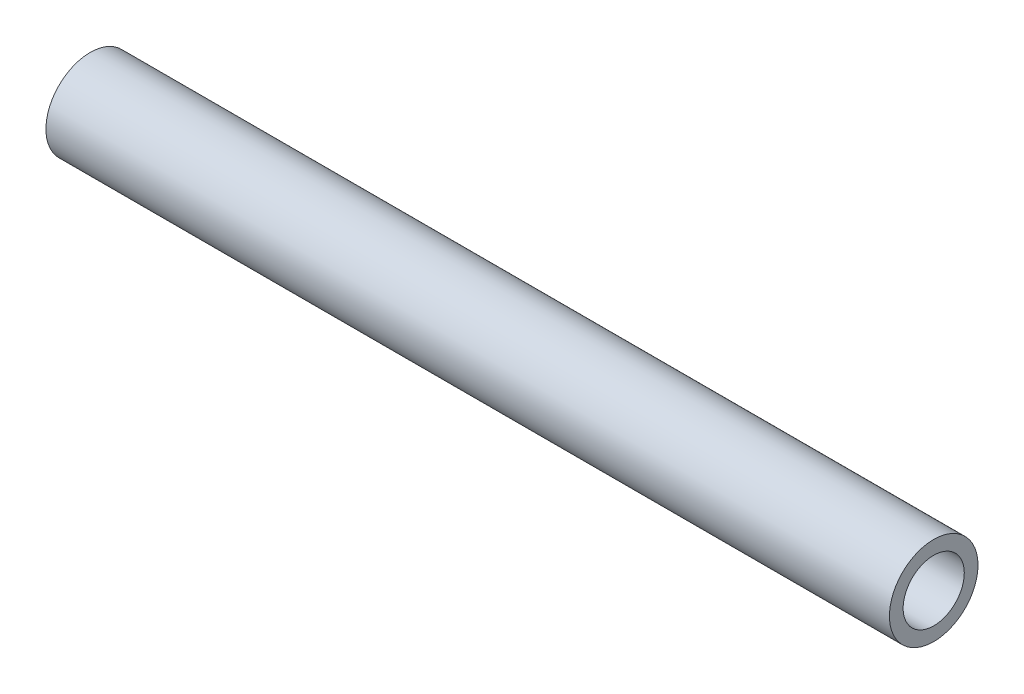
ISO-10303-21;
HEADER;
FILE_DESCRIPTION(('STEP AP214'),'2;1');
FILE_NAME('part.step','',(''),(''),'','','');
FILE_SCHEMA(('AUTOMOTIVE_DESIGN { 1 0 10303 214 1 1 1 1 }'));
ENDSEC;
DATA;
#1=APPLICATION_CONTEXT('core data for automotive mechanical design processes');
#2=APPLICATION_PROTOCOL_DEFINITION('international standard','automotive_design',2000,#1);
#3=PRODUCT_CONTEXT('',#1,'mechanical');
#4=PRODUCT('Part','Part','',(#3));
#5=PRODUCT_RELATED_PRODUCT_CATEGORY('part','',(#4));
#6=PRODUCT_DEFINITION_FORMATION('','',#4);
#7=PRODUCT_DEFINITION_CONTEXT('part definition',#1,'design');
#8=PRODUCT_DEFINITION('design','',#6,#7);
#9=PRODUCT_DEFINITION_SHAPE('','',#8);
#10=(LENGTH_UNIT() NAMED_UNIT(*) SI_UNIT(.MILLI.,.METRE.));
#11=(NAMED_UNIT(*) PLANE_ANGLE_UNIT() SI_UNIT($,.RADIAN.));
#12=(NAMED_UNIT(*) SI_UNIT($,.STERADIAN.) SOLID_ANGLE_UNIT());
#13=UNCERTAINTY_MEASURE_WITH_UNIT(LENGTH_MEASURE(1.E-05),#10,'distance_accuracy_value','');
#14=(GEOMETRIC_REPRESENTATION_CONTEXT(3) GLOBAL_UNCERTAINTY_ASSIGNED_CONTEXT((#13)) GLOBAL_UNIT_ASSIGNED_CONTEXT((#10,
#11,#12)) REPRESENTATION_CONTEXT('',''));
#15=CARTESIAN_POINT('',(0.,0.,0.));
#16=DIRECTION('',(0.,0.,1.));
#17=DIRECTION('',(1.,0.,0.));
#18=AXIS2_PLACEMENT_3D('',#15,#16,#17);
#19=CARTESIAN_POINT('',(-203.2,0.,0.));
#20=DIRECTION('',(1.,0.,0.));
#21=DIRECTION('',(0.,0.,-1.));
#22=AXIS2_PLACEMENT_3D('',#19,#20,#21);
#23=CYLINDRICAL_SURFACE('',#22,10.668);
#24=CARTESIAN_POINT('',(-203.2,0.,0.));
#25=DIRECTION('',(1.,0.,0.));
#26=DIRECTION('',(0.,0.,-1.));
#27=AXIS2_PLACEMENT_3D('',#24,#25,#26);
#28=CIRCLE('',#27,10.668);
#29=CARTESIAN_POINT('',(-203.2,0.,-10.668));
#30=VERTEX_POINT('',#29);
#31=EDGE_CURVE('E12',#30,#30,#28,.T.);
#32=ORIENTED_EDGE('',*,*,#31,.T.);
#33=EDGE_LOOP('',(#32));
#34=FACE_BOUND('',#33,.T.);
#35=CARTESIAN_POINT('',(0.,0.,0.));
#36=DIRECTION('',(1.,0.,0.));
#37=DIRECTION('',(0.,0.,-1.));
#38=AXIS2_PLACEMENT_3D('',#35,#36,#37);
#39=CIRCLE('',#38,10.668);
#40=CARTESIAN_POINT('',(0.,0.,-10.668));
#41=VERTEX_POINT('',#40);
#42=EDGE_CURVE('E48',#41,#41,#39,.T.);
#43=ORIENTED_EDGE('',*,*,#42,.F.);
#44=EDGE_LOOP('',(#43));
#45=FACE_BOUND('',#44,.T.);
#46=ADVANCED_FACE('F45',(#34,#45),#23,.T.);
#47=CARTESIAN_POINT('',(-203.2,0.,0.));
#48=DIRECTION('',(1.,0.,0.));
#49=DIRECTION('',(0.,0.,-1.));
#50=AXIS2_PLACEMENT_3D('',#47,#48,#49);
#51=PLANE('',#50);
#52=CARTESIAN_POINT('',(-203.2,0.,0.));
#53=DIRECTION('',(1.,0.,0.));
#54=DIRECTION('',(0.,0.,-1.));
#55=AXIS2_PLACEMENT_3D('',#52,#53,#54);
#56=CIRCLE('',#55,7.366);
#57=CARTESIAN_POINT('',(-203.2,0.,-7.366));
#58=VERTEX_POINT('',#57);
#59=EDGE_CURVE('E55',#58,#58,#56,.T.);
#60=ORIENTED_EDGE('',*,*,#59,.T.);
#61=EDGE_LOOP('',(#60));
#62=FACE_BOUND('',#61,.T.);
#63=ORIENTED_EDGE('',*,*,#31,.F.);
#64=EDGE_LOOP('',(#63));
#65=FACE_BOUND('',#64,.T.);
#66=ADVANCED_FACE('F63',(#62,#65),#51,.F.);
#67=CARTESIAN_POINT('',(0.,0.,0.));
#68=DIRECTION('',(1.,0.,0.));
#69=DIRECTION('',(0.,0.,-1.));
#70=AXIS2_PLACEMENT_3D('',#67,#68,#69);
#71=PLANE('',#70);
#72=CARTESIAN_POINT('',(0.,0.,0.));
#73=DIRECTION('',(1.,0.,0.));
#74=DIRECTION('',(0.,0.,-1.));
#75=AXIS2_PLACEMENT_3D('',#72,#73,#74);
#76=CIRCLE('',#75,7.366);
#77=CARTESIAN_POINT('',(0.,0.,-7.366));
#78=VERTEX_POINT('',#77);
#79=EDGE_CURVE('E57',#78,#78,#76,.T.);
#80=ORIENTED_EDGE('',*,*,#79,.F.);
#81=EDGE_LOOP('',(#80));
#82=FACE_BOUND('',#81,.T.);
#83=ORIENTED_EDGE('',*,*,#42,.T.);
#84=EDGE_LOOP('',(#83));
#85=FACE_BOUND('',#84,.T.);
#86=ADVANCED_FACE('F69',(#82,#85),#71,.T.);
#87=CARTESIAN_POINT('',(-203.2,0.,0.));
#88=DIRECTION('',(1.,0.,0.));
#89=DIRECTION('',(0.,0.,-1.));
#90=AXIS2_PLACEMENT_3D('',#87,#88,#89);
#91=CYLINDRICAL_SURFACE('',#90,7.366);
#92=ORIENTED_EDGE('',*,*,#59,.F.);
#93=EDGE_LOOP('',(#92));
#94=FACE_BOUND('',#93,.T.);
#95=ORIENTED_EDGE('',*,*,#79,.T.);
#96=EDGE_LOOP('',(#95));
#97=FACE_BOUND('',#96,.T.);
#98=ADVANCED_FACE('F66',(#94,#97),#91,.F.);
#99=CLOSED_SHELL('',(#46,#66,#86,#98));
#100=MANIFOLD_SOLID_BREP('B2',#99);
#101=ADVANCED_BREP_SHAPE_REPRESENTATION('',(#18,#100),#14);
#102=SHAPE_DEFINITION_REPRESENTATION(#9,#101);
ENDSEC;
END-ISO-10303-21;
